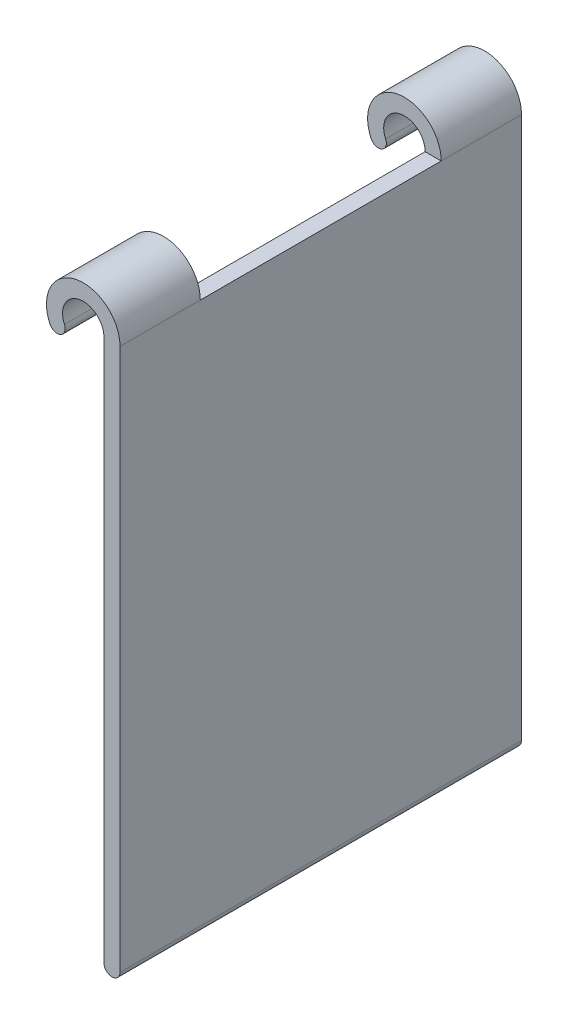
ISO-10303-21;
HEADER;
FILE_DESCRIPTION(('STEP AP214'),'2;1');
FILE_NAME('part.step','',(''),(''),'','','');
FILE_SCHEMA(('AUTOMOTIVE_DESIGN { 1 0 10303 214 1 1 1 1 }'));
ENDSEC;
DATA;
#1=APPLICATION_CONTEXT('core data for automotive mechanical design processes');
#2=APPLICATION_PROTOCOL_DEFINITION('international standard','automotive_design',2000,#1);
#3=PRODUCT_CONTEXT('',#1,'mechanical');
#4=PRODUCT('Part','Part','',(#3));
#5=PRODUCT_RELATED_PRODUCT_CATEGORY('part','',(#4));
#6=PRODUCT_DEFINITION_FORMATION('','',#4);
#7=PRODUCT_DEFINITION_CONTEXT('part definition',#1,'design');
#8=PRODUCT_DEFINITION('design','',#6,#7);
#9=PRODUCT_DEFINITION_SHAPE('','',#8);
#10=(LENGTH_UNIT() NAMED_UNIT(*) SI_UNIT(.MILLI.,.METRE.));
#11=(NAMED_UNIT(*) PLANE_ANGLE_UNIT() SI_UNIT($,.RADIAN.));
#12=(NAMED_UNIT(*) SI_UNIT($,.STERADIAN.) SOLID_ANGLE_UNIT());
#13=UNCERTAINTY_MEASURE_WITH_UNIT(LENGTH_MEASURE(1.E-05),#10,'distance_accuracy_value','');
#14=(GEOMETRIC_REPRESENTATION_CONTEXT(3) GLOBAL_UNCERTAINTY_ASSIGNED_CONTEXT((#13)) GLOBAL_UNIT_ASSIGNED_CONTEXT((#10,
#11,#12)) REPRESENTATION_CONTEXT('',''));
#15=CARTESIAN_POINT('',(0.,0.,0.));
#16=DIRECTION('',(0.,0.,1.));
#17=DIRECTION('',(1.,0.,0.));
#18=AXIS2_PLACEMENT_3D('',#15,#16,#17);
#19=CARTESIAN_POINT('',(3.2766,0.,57.15));
#20=DIRECTION('',(0.,-1.,0.));
#21=DIRECTION('',(0.,0.,-1.));
#22=AXIS2_PLACEMENT_3D('',#19,#20,#21);
#23=PLANE('',#22);
#24=DIRECTION('',(-1.,0.,0.));
#25=VECTOR('',#24,1.);
#26=CARTESIAN_POINT('',(3.2766,0.,44.45));
#27=LINE('',#26,#25);
#28=CARTESIAN_POINT('',(5.81660000000001,0.,44.45));
#29=VERTEX_POINT('',#28);
#30=CARTESIAN_POINT('',(3.27659999999998,0.,44.45));
#31=VERTEX_POINT('',#30);
#32=EDGE_CURVE('E11',#29,#31,#27,.T.);
#33=ORIENTED_EDGE('',*,*,#32,.F.);
#34=DIRECTION('',(0.,0.,-1.));
#35=VECTOR('',#34,1.);
#36=CARTESIAN_POINT('',(5.81660000000001,0.,57.15));
#37=LINE('',#36,#35);
#38=CARTESIAN_POINT('',(5.8166,0.,6.35));
#39=VERTEX_POINT('',#38);
#40=EDGE_CURVE('E199',#29,#39,#37,.T.);
#41=ORIENTED_EDGE('',*,*,#40,.T.);
#42=DIRECTION('',(-1.,0.,0.));
#43=VECTOR('',#42,1.);
#44=CARTESIAN_POINT('',(3.2766,0.,6.35));
#45=LINE('',#44,#43);
#46=CARTESIAN_POINT('',(3.2766,0.,6.35));
#47=VERTEX_POINT('',#46);
#48=EDGE_CURVE('E185',#39,#47,#45,.T.);
#49=ORIENTED_EDGE('',*,*,#48,.T.);
#50=DIRECTION('',(0.,0.,-1.));
#51=VECTOR('',#50,1.);
#52=CARTESIAN_POINT('',(3.2766,0.,57.15));
#53=LINE('',#52,#51);
#54=EDGE_CURVE('E194',#31,#47,#53,.T.);
#55=ORIENTED_EDGE('',*,*,#54,.F.);
#56=EDGE_LOOP('',(#33,#41,#49,#55));
#57=FACE_BOUND('',#56,.T.);
#58=ADVANCED_FACE('F40',(#57),#23,.F.);
#59=CARTESIAN_POINT('',(4.54660000000001,-85.725,6.35));
#60=DIRECTION('',(0.,0.,-1.));
#61=DIRECTION('',(-1.,0.,0.));
#62=AXIS2_PLACEMENT_3D('',#59,#60,#61);
#63=CYLINDRICAL_SURFACE('',#62,1.27);
#64=DIRECTION('',(0.,0.,-1.));
#65=VECTOR('',#64,1.);
#66=CARTESIAN_POINT('',(3.27660000000002,-85.725,6.35));
#67=LINE('',#66,#65);
#68=CARTESIAN_POINT('',(3.2766,-85.725,57.15));
#69=VERTEX_POINT('',#68);
#70=CARTESIAN_POINT('',(3.27660000000002,-85.725,-6.35));
#71=VERTEX_POINT('',#70);
#72=EDGE_CURVE('E212',#69,#71,#67,.T.);
#73=ORIENTED_EDGE('',*,*,#72,.T.);
#74=CARTESIAN_POINT('',(4.54660000000001,-85.725,-6.35));
#75=DIRECTION('',(0.,0.,1.));
#76=DIRECTION('',(1.,0.,0.));
#77=AXIS2_PLACEMENT_3D('',#74,#75,#76);
#78=CIRCLE('',#77,1.27);
#79=CARTESIAN_POINT('',(5.81660000000001,-85.725,-6.35));
#80=VERTEX_POINT('',#79);
#81=EDGE_CURVE('E203',#71,#80,#78,.T.);
#82=ORIENTED_EDGE('',*,*,#81,.T.);
#83=DIRECTION('',(0.,0.,-1.));
#84=VECTOR('',#83,1.);
#85=CARTESIAN_POINT('',(5.81660000000001,-85.725,6.35));
#86=LINE('',#85,#84);
#87=CARTESIAN_POINT('',(5.81660000000001,-85.725,57.15));
#88=VERTEX_POINT('',#87);
#89=EDGE_CURVE('E48',#88,#80,#86,.T.);
#90=ORIENTED_EDGE('',*,*,#89,.F.);
#91=CARTESIAN_POINT('',(4.54660000000001,-85.725,57.15));
#92=DIRECTION('',(0.,0.,1.));
#93=DIRECTION('',(1.,0.,0.));
#94=AXIS2_PLACEMENT_3D('',#91,#92,#93);
#95=CIRCLE('',#94,1.27000000000001);
#96=EDGE_CURVE('E189',#69,#88,#95,.T.);
#97=ORIENTED_EDGE('',*,*,#96,.F.);
#98=EDGE_LOOP('',(#73,#82,#90,#97));
#99=FACE_BOUND('',#98,.T.);
#100=ADVANCED_FACE('F42',(#99),#63,.T.);
#101=CARTESIAN_POINT('',(5.8166,0.,6.35));
#102=DIRECTION('',(-1.,0.,0.));
#103=DIRECTION('',(0.,-1.,0.));
#104=AXIS2_PLACEMENT_3D('',#101,#102,#103);
#105=PLANE('',#104);
#106=ORIENTED_EDGE('',*,*,#89,.T.);
#107=DIRECTION('',(0.,1.,0.));
#108=VECTOR('',#107,1.);
#109=CARTESIAN_POINT('',(5.8166,0.,-6.35));
#110=LINE('',#109,#108);
#111=CARTESIAN_POINT('',(5.8166,0.,-6.35));
#112=VERTEX_POINT('',#111);
#113=EDGE_CURVE('E215',#80,#112,#110,.T.);
#114=ORIENTED_EDGE('',*,*,#113,.T.);
#115=DIRECTION('',(0.,0.,-1.));
#116=VECTOR('',#115,1.);
#117=CARTESIAN_POINT('',(5.8166,0.,6.35));
#118=LINE('',#117,#116);
#119=EDGE_CURVE('E235',#39,#112,#118,.T.);
#120=ORIENTED_EDGE('',*,*,#119,.F.);
#121=ORIENTED_EDGE('',*,*,#40,.F.);
#122=CARTESIAN_POINT('',(5.81660000000001,0.,57.15));
#123=VERTEX_POINT('',#122);
#124=EDGE_CURVE('E200',#123,#29,#37,.T.);
#125=ORIENTED_EDGE('',*,*,#124,.F.);
#126=DIRECTION('',(0.,1.,0.));
#127=VECTOR('',#126,1.);
#128=CARTESIAN_POINT('',(5.81660000000001,0.,57.15));
#129=LINE('',#128,#127);
#130=EDGE_CURVE('E192',#88,#123,#129,.T.);
#131=ORIENTED_EDGE('',*,*,#130,.F.);
#132=EDGE_LOOP('',(#106,#114,#120,#121,#125,#131));
#133=FACE_BOUND('',#132,.T.);
#134=ADVANCED_FACE('F240',(#133),#105,.F.);
#135=CARTESIAN_POINT('',(0.,0.,6.35));
#136=DIRECTION('',(0.,0.,-1.));
#137=DIRECTION('',(-1.,0.,0.));
#138=AXIS2_PLACEMENT_3D('',#135,#136,#137);
#139=CYLINDRICAL_SURFACE('',#138,5.8166);
#140=CARTESIAN_POINT('',(0.,0.,-6.35));
#141=DIRECTION('',(0.,0.,1.));
#142=DIRECTION('',(1.,0.,0.));
#143=AXIS2_PLACEMENT_3D('',#140,#141,#142);
#144=CIRCLE('',#143,5.8166);
#145=CARTESIAN_POINT('',(-5.27162987407737,-2.45820138124096,-6.35));
#146=VERTEX_POINT('',#145);
#147=EDGE_CURVE('E217',#112,#146,#144,.T.);
#148=ORIENTED_EDGE('',*,*,#147,.T.);
#149=DIRECTION('',(0.,0.,-1.));
#150=VECTOR('',#149,1.);
#151=CARTESIAN_POINT('',(-5.27162987407737,-2.45820138124096,6.35));
#152=LINE('',#151,#150);
#153=CARTESIAN_POINT('',(-5.27162987407737,-2.45820138124096,6.35));
#154=VERTEX_POINT('',#153);
#155=EDGE_CURVE('E232',#154,#146,#152,.T.);
#156=ORIENTED_EDGE('',*,*,#155,.F.);
#157=CARTESIAN_POINT('',(0.,0.,6.35));
#158=DIRECTION('',(0.,0.,1.));
#159=DIRECTION('',(1.,0.,0.));
#160=AXIS2_PLACEMENT_3D('',#157,#158,#159);
#161=CIRCLE('',#160,5.8166);
#162=EDGE_CURVE('E204',#39,#154,#161,.T.);
#163=ORIENTED_EDGE('',*,*,#162,.F.);
#164=ORIENTED_EDGE('',*,*,#119,.T.);
#165=EDGE_LOOP('',(#148,#156,#163,#164));
#166=FACE_BOUND('',#165,.T.);
#167=ADVANCED_FACE('F265',(#166),#139,.T.);
#168=CARTESIAN_POINT('',(-4.12061898454083,-1.92147618883027,6.35));
#169=DIRECTION('',(0.,0.,-1.));
#170=DIRECTION('',(-1.,0.,0.));
#171=AXIS2_PLACEMENT_3D('',#168,#169,#170);
#172=CYLINDRICAL_SURFACE('',#171,1.27);
#173=CARTESIAN_POINT('',(-4.12061898454083,-1.92147618883027,-6.35));
#174=DIRECTION('',(0.,0.,1.));
#175=DIRECTION('',(1.,0.,0.));
#176=AXIS2_PLACEMENT_3D('',#173,#174,#175);
#177=CIRCLE('',#176,1.27);
#178=CARTESIAN_POINT('',(-2.96960809500428,-1.38475099641958,-6.35));
#179=VERTEX_POINT('',#178);
#180=EDGE_CURVE('E219',#146,#179,#177,.T.);
#181=ORIENTED_EDGE('',*,*,#180,.T.);
#182=DIRECTION('',(0.,0.,-1.));
#183=VECTOR('',#182,1.);
#184=CARTESIAN_POINT('',(-2.96960809500428,-1.38475099641958,6.35));
#185=LINE('',#184,#183);
#186=CARTESIAN_POINT('',(-2.96960809500428,-1.38475099641958,6.35));
#187=VERTEX_POINT('',#186);
#188=EDGE_CURVE('E229',#187,#179,#185,.T.);
#189=ORIENTED_EDGE('',*,*,#188,.F.);
#190=CARTESIAN_POINT('',(-4.12061898454083,-1.92147618883027,6.35));
#191=DIRECTION('',(0.,0.,1.));
#192=DIRECTION('',(1.,0.,0.));
#193=AXIS2_PLACEMENT_3D('',#190,#191,#192);
#194=CIRCLE('',#193,1.27);
#195=EDGE_CURVE('E206',#154,#187,#194,.T.);
#196=ORIENTED_EDGE('',*,*,#195,.F.);
#197=ORIENTED_EDGE('',*,*,#155,.T.);
#198=EDGE_LOOP('',(#181,#189,#196,#197));
#199=FACE_BOUND('',#198,.T.);
#200=ADVANCED_FACE('F261',(#199),#172,.T.);
#201=CARTESIAN_POINT('',(0.,0.,6.35));
#202=DIRECTION('',(0.,0.,-1.));
#203=DIRECTION('',(-1.,0.,0.));
#204=AXIS2_PLACEMENT_3D('',#201,#202,#203);
#205=CYLINDRICAL_SURFACE('',#204,3.2766);
#206=CARTESIAN_POINT('',(0.,0.,-6.35));
#207=DIRECTION('',(0.,0.,-1.));
#208=DIRECTION('',(1.,0.,0.));
#209=AXIS2_PLACEMENT_3D('',#206,#207,#208);
#210=CIRCLE('',#209,3.2766);
#211=CARTESIAN_POINT('',(3.2766,0.,-6.35));
#212=VERTEX_POINT('',#211);
#213=EDGE_CURVE('E221',#179,#212,#210,.T.);
#214=ORIENTED_EDGE('',*,*,#213,.T.);
#215=DIRECTION('',(0.,0.,-1.));
#216=VECTOR('',#215,1.);
#217=CARTESIAN_POINT('',(3.2766,0.,6.35));
#218=LINE('',#217,#216);
#219=EDGE_CURVE('E226',#47,#212,#218,.T.);
#220=ORIENTED_EDGE('',*,*,#219,.F.);
#221=CARTESIAN_POINT('',(0.,0.,6.35));
#222=DIRECTION('',(0.,0.,-1.));
#223=DIRECTION('',(1.,0.,0.));
#224=AXIS2_PLACEMENT_3D('',#221,#222,#223);
#225=CIRCLE('',#224,3.2766);
#226=EDGE_CURVE('E209',#187,#47,#225,.T.);
#227=ORIENTED_EDGE('',*,*,#226,.F.);
#228=ORIENTED_EDGE('',*,*,#188,.T.);
#229=EDGE_LOOP('',(#214,#220,#227,#228));
#230=FACE_BOUND('',#229,.T.);
#231=ADVANCED_FACE('F256',(#230),#205,.F.);
#232=CARTESIAN_POINT('',(3.2766,0.,6.35));
#233=DIRECTION('',(1.,0.,0.));
#234=DIRECTION('',(0.,1.,0.));
#235=AXIS2_PLACEMENT_3D('',#232,#233,#234);
#236=PLANE('',#235);
#237=DIRECTION('',(0.,0.,-1.));
#238=VECTOR('',#237,1.);
#239=CARTESIAN_POINT('',(3.2766,-66.802,31.75));
#240=LINE('',#239,#238);
#241=CARTESIAN_POINT('',(3.2766,-66.802,31.75));
#242=VERTEX_POINT('',#241);
#243=CARTESIAN_POINT('',(3.27660000000001,-66.802,19.05));
#244=VERTEX_POINT('',#243);
#245=EDGE_CURVE('E55',#242,#244,#240,.T.);
#246=ORIENTED_EDGE('',*,*,#245,.F.);
#247=DIRECTION('',(0.,1.,0.));
#248=VECTOR('',#247,1.);
#249=CARTESIAN_POINT('',(3.2766,-66.802,31.75));
#250=LINE('',#249,#248);
#251=CARTESIAN_POINT('',(3.27660000000002,-71.6079055338198,31.75));
#252=VERTEX_POINT('',#251);
#253=EDGE_CURVE('E59',#252,#242,#250,.T.);
#254=ORIENTED_EDGE('',*,*,#253,.F.);
#255=DIRECTION('',(0.,0.,-1.));
#256=VECTOR('',#255,1.);
#257=CARTESIAN_POINT('',(3.2766,-71.6079055338198,31.75));
#258=LINE('',#257,#256);
#259=CARTESIAN_POINT('',(3.2766,-71.6079055338198,19.05));
#260=VERTEX_POINT('',#259);
#261=EDGE_CURVE('E164',#252,#260,#258,.T.);
#262=ORIENTED_EDGE('',*,*,#261,.T.);
#263=DIRECTION('',(0.,1.,0.));
#264=VECTOR('',#263,1.);
#265=CARTESIAN_POINT('',(3.2766,-66.802,19.05));
#266=LINE('',#265,#264);
#267=EDGE_CURVE('E155',#260,#244,#266,.T.);
#268=ORIENTED_EDGE('',*,*,#267,.T.);
#269=EDGE_LOOP('',(#246,#254,#262,#268));
#270=FACE_BOUND('',#269,.T.);
#271=CARTESIAN_POINT('',(3.2766,0.,57.15));
#272=VERTEX_POINT('',#271);
#273=EDGE_CURVE('E197',#272,#31,#53,.T.);
#274=ORIENTED_EDGE('',*,*,#273,.T.);
#275=ORIENTED_EDGE('',*,*,#54,.T.);
#276=ORIENTED_EDGE('',*,*,#219,.T.);
#277=DIRECTION('',(0.,-1.,0.));
#278=VECTOR('',#277,1.);
#279=CARTESIAN_POINT('',(3.2766,0.,-6.35));
#280=LINE('',#279,#278);
#281=EDGE_CURVE('E207',#212,#71,#280,.T.);
#282=ORIENTED_EDGE('',*,*,#281,.T.);
#283=ORIENTED_EDGE('',*,*,#72,.F.);
#284=DIRECTION('',(0.,-1.,0.));
#285=VECTOR('',#284,1.);
#286=CARTESIAN_POINT('',(3.2766,0.,57.15));
#287=LINE('',#286,#285);
#288=EDGE_CURVE('E186',#272,#69,#287,.T.);
#289=ORIENTED_EDGE('',*,*,#288,.F.);
#290=EDGE_LOOP('',(#274,#275,#276,#282,#283,#289));
#291=FACE_BOUND('',#290,.T.);
#292=ADVANCED_FACE('F252',(#270,#291),#236,.F.);
#293=CARTESIAN_POINT('',(4.54660000000001,-85.725,6.35));
#294=DIRECTION('',(0.,0.,1.));
#295=DIRECTION('',(1.,0.,0.));
#296=AXIS2_PLACEMENT_3D('',#293,#294,#295);
#297=PLANE('',#296);
#298=ORIENTED_EDGE('',*,*,#48,.F.);
#299=ORIENTED_EDGE('',*,*,#162,.T.);
#300=ORIENTED_EDGE('',*,*,#195,.T.);
#301=ORIENTED_EDGE('',*,*,#226,.T.);
#302=EDGE_LOOP('',(#298,#299,#300,#301));
#303=FACE_BOUND('',#302,.T.);
#304=ADVANCED_FACE('F290',(#303),#297,.T.);
#305=CARTESIAN_POINT('',(4.54660000000001,-85.725,-6.35));
#306=DIRECTION('',(0.,0.,1.));
#307=DIRECTION('',(1.,0.,0.));
#308=AXIS2_PLACEMENT_3D('',#305,#306,#307);
#309=PLANE('',#308);
#310=ORIENTED_EDGE('',*,*,#81,.F.);
#311=ORIENTED_EDGE('',*,*,#281,.F.);
#312=ORIENTED_EDGE('',*,*,#213,.F.);
#313=ORIENTED_EDGE('',*,*,#180,.F.);
#314=ORIENTED_EDGE('',*,*,#147,.F.);
#315=ORIENTED_EDGE('',*,*,#113,.F.);
#316=EDGE_LOOP('',(#310,#311,#312,#313,#314,#315));
#317=FACE_BOUND('',#316,.T.);
#318=ADVANCED_FACE('F248',(#317),#309,.F.);
#319=CARTESIAN_POINT('',(4.54660000000001,-85.725,57.15));
#320=DIRECTION('',(0.,0.,1.));
#321=DIRECTION('',(1.,0.,0.));
#322=AXIS2_PLACEMENT_3D('',#319,#320,#321);
#323=PLANE('',#322);
#324=ORIENTED_EDGE('',*,*,#288,.T.);
#325=ORIENTED_EDGE('',*,*,#96,.T.);
#326=ORIENTED_EDGE('',*,*,#130,.T.);
#327=CARTESIAN_POINT('',(0.,0.,57.15));
#328=DIRECTION('',(0.,0.,1.));
#329=DIRECTION('',(1.,0.,0.));
#330=AXIS2_PLACEMENT_3D('',#327,#328,#329);
#331=CIRCLE('',#330,5.8166);
#332=CARTESIAN_POINT('',(-5.27162987407739,-2.45820138124096,57.15));
#333=VERTEX_POINT('',#332);
#334=EDGE_CURVE('E168',#123,#333,#331,.T.);
#335=ORIENTED_EDGE('',*,*,#334,.T.);
#336=CARTESIAN_POINT('',(-4.12061898454084,-1.92147618883027,57.15));
#337=DIRECTION('',(0.,0.,1.));
#338=DIRECTION('',(1.,0.,0.));
#339=AXIS2_PLACEMENT_3D('',#336,#337,#338);
#340=CIRCLE('',#339,1.27);
#341=CARTESIAN_POINT('',(-2.9696080950043,-1.38475099641958,57.15));
#342=VERTEX_POINT('',#341);
#343=EDGE_CURVE('E170',#333,#342,#340,.T.);
#344=ORIENTED_EDGE('',*,*,#343,.T.);
#345=CARTESIAN_POINT('',(0.,0.,57.15));
#346=DIRECTION('',(0.,0.,-1.));
#347=DIRECTION('',(1.,0.,0.));
#348=AXIS2_PLACEMENT_3D('',#345,#346,#347);
#349=CIRCLE('',#348,3.2766);
#350=EDGE_CURVE('E173',#342,#272,#349,.T.);
#351=ORIENTED_EDGE('',*,*,#350,.T.);
#352=EDGE_LOOP('',(#324,#325,#326,#335,#344,#351));
#353=FACE_BOUND('',#352,.T.);
#354=ADVANCED_FACE('F287',(#353),#323,.T.);
#355=CARTESIAN_POINT('',(4.5466,-85.725,44.45));
#356=DIRECTION('',(0.,0.,1.));
#357=DIRECTION('',(1.,0.,0.));
#358=AXIS2_PLACEMENT_3D('',#355,#356,#357);
#359=PLANE('',#358);
#360=CARTESIAN_POINT('',(0.,0.,44.45));
#361=DIRECTION('',(0.,0.,1.));
#362=DIRECTION('',(1.,0.,0.));
#363=AXIS2_PLACEMENT_3D('',#360,#361,#362);
#364=CIRCLE('',#363,5.8166);
#365=CARTESIAN_POINT('',(-5.27162987407739,-2.45820138124096,44.45));
#366=VERTEX_POINT('',#365);
#367=EDGE_CURVE('E160',#29,#366,#364,.T.);
#368=ORIENTED_EDGE('',*,*,#367,.F.);
#369=ORIENTED_EDGE('',*,*,#32,.T.);
#370=CARTESIAN_POINT('',(0.,0.,44.45));
#371=DIRECTION('',(0.,0.,-1.));
#372=DIRECTION('',(1.,0.,0.));
#373=AXIS2_PLACEMENT_3D('',#370,#371,#372);
#374=CIRCLE('',#373,3.2766);
#375=CARTESIAN_POINT('',(-2.9696080950043,-1.38475099641958,44.45));
#376=VERTEX_POINT('',#375);
#377=EDGE_CURVE('E171',#376,#31,#374,.T.);
#378=ORIENTED_EDGE('',*,*,#377,.F.);
#379=CARTESIAN_POINT('',(-4.12061898454084,-1.92147618883027,44.45));
#380=DIRECTION('',(0.,0.,1.));
#381=DIRECTION('',(1.,0.,0.));
#382=AXIS2_PLACEMENT_3D('',#379,#380,#381);
#383=CIRCLE('',#382,1.27);
#384=EDGE_CURVE('E162',#366,#376,#383,.T.);
#385=ORIENTED_EDGE('',*,*,#384,.F.);
#386=EDGE_LOOP('',(#368,#369,#378,#385));
#387=FACE_BOUND('',#386,.T.);
#388=ADVANCED_FACE('F276',(#387),#359,.F.);
#389=CARTESIAN_POINT('',(0.,0.,57.15));
#390=DIRECTION('',(0.,0.,-1.));
#391=DIRECTION('',(-1.,0.,0.));
#392=AXIS2_PLACEMENT_3D('',#389,#390,#391);
#393=CYLINDRICAL_SURFACE('',#392,5.8166);
#394=ORIENTED_EDGE('',*,*,#367,.T.);
#395=DIRECTION('',(0.,0.,-1.));
#396=VECTOR('',#395,1.);
#397=CARTESIAN_POINT('',(-5.27162987407739,-2.45820138124096,57.15));
#398=LINE('',#397,#396);
#399=EDGE_CURVE('E182',#333,#366,#398,.T.);
#400=ORIENTED_EDGE('',*,*,#399,.F.);
#401=ORIENTED_EDGE('',*,*,#334,.F.);
#402=ORIENTED_EDGE('',*,*,#124,.T.);
#403=EDGE_LOOP('',(#394,#400,#401,#402));
#404=FACE_BOUND('',#403,.T.);
#405=ADVANCED_FACE('F272',(#404),#393,.T.);
#406=CARTESIAN_POINT('',(-4.12061898454084,-1.92147618883027,57.15));
#407=DIRECTION('',(0.,0.,-1.));
#408=DIRECTION('',(-1.,0.,0.));
#409=AXIS2_PLACEMENT_3D('',#406,#407,#408);
#410=CYLINDRICAL_SURFACE('',#409,1.27);
#411=ORIENTED_EDGE('',*,*,#384,.T.);
#412=DIRECTION('',(0.,0.,-1.));
#413=VECTOR('',#412,1.);
#414=CARTESIAN_POINT('',(-2.9696080950043,-1.38475099641958,57.15));
#415=LINE('',#414,#413);
#416=EDGE_CURVE('E175',#342,#376,#415,.T.);
#417=ORIENTED_EDGE('',*,*,#416,.F.);
#418=ORIENTED_EDGE('',*,*,#343,.F.);
#419=ORIENTED_EDGE('',*,*,#399,.T.);
#420=EDGE_LOOP('',(#411,#417,#418,#419));
#421=FACE_BOUND('',#420,.T.);
#422=ADVANCED_FACE('F280',(#421),#410,.T.);
#423=CARTESIAN_POINT('',(0.,0.,57.15));
#424=DIRECTION('',(0.,0.,-1.));
#425=DIRECTION('',(-1.,0.,0.));
#426=AXIS2_PLACEMENT_3D('',#423,#424,#425);
#427=CYLINDRICAL_SURFACE('',#426,3.2766);
#428=ORIENTED_EDGE('',*,*,#377,.T.);
#429=ORIENTED_EDGE('',*,*,#273,.F.);
#430=ORIENTED_EDGE('',*,*,#350,.F.);
#431=ORIENTED_EDGE('',*,*,#416,.T.);
#432=EDGE_LOOP('',(#428,#429,#430,#431));
#433=FACE_BOUND('',#432,.T.);
#434=ADVANCED_FACE('F284',(#433),#427,.F.);
#435=CARTESIAN_POINT('',(0.,-66.802,31.75));
#436=DIRECTION('',(0.,0.,-1.));
#437=DIRECTION('',(-1.,0.,0.));
#438=AXIS2_PLACEMENT_3D('',#435,#436,#437);
#439=CYLINDRICAL_SURFACE('',#438,3.27659999999999);
#440=CARTESIAN_POINT('',(0.,-66.802,19.05));
#441=DIRECTION('',(0.,0.,-1.));
#442=DIRECTION('',(1.,0.,0.));
#443=AXIS2_PLACEMENT_3D('',#440,#441,#442);
#444=CIRCLE('',#443,3.27659999999999);
#445=CARTESIAN_POINT('',(-2.83761883804006,-65.1637,19.05));
#446=VERTEX_POINT('',#445);
#447=EDGE_CURVE('E159',#244,#446,#444,.T.);
#448=ORIENTED_EDGE('',*,*,#447,.T.);
#449=DIRECTION('',(0.,0.,-1.));
#450=VECTOR('',#449,1.);
#451=CARTESIAN_POINT('',(-2.83761883804006,-65.1637,31.75));
#452=LINE('',#451,#450);
#453=CARTESIAN_POINT('',(-2.83761883804006,-65.1637,31.75));
#454=VERTEX_POINT('',#453);
#455=EDGE_CURVE('E143',#454,#446,#452,.T.);
#456=ORIENTED_EDGE('',*,*,#455,.F.);
#457=CARTESIAN_POINT('',(0.,-66.802,31.75));
#458=DIRECTION('',(0.,0.,-1.));
#459=DIRECTION('',(1.,0.,0.));
#460=AXIS2_PLACEMENT_3D('',#457,#458,#459);
#461=CIRCLE('',#460,3.27659999999999);
#462=EDGE_CURVE('E150',#242,#454,#461,.T.);
#463=ORIENTED_EDGE('',*,*,#462,.F.);
#464=ORIENTED_EDGE('',*,*,#245,.T.);
#465=EDGE_LOOP('',(#448,#456,#463,#464));
#466=FACE_BOUND('',#465,.T.);
#467=ADVANCED_FACE('F157',(#466),#439,.F.);
#468=CARTESIAN_POINT('',(-5.03732336365255,-63.8937,31.75));
#469=DIRECTION('',(-0.499999999999996,-0.866025403784441,0.));
#470=DIRECTION('',(0.866025403784441,-0.499999999999996,0.));
#471=AXIS2_PLACEMENT_3D('',#468,#469,#470);
#472=PLANE('',#471);
#473=DIRECTION('',(-0.866025403784441,0.499999999999996,0.));
#474=VECTOR('',#473,1.);
#475=CARTESIAN_POINT('',(-5.03732336365255,-63.8937,19.05));
#476=LINE('',#475,#474);
#477=CARTESIAN_POINT('',(-5.03732336365255,-63.8937,19.05));
#478=VERTEX_POINT('',#477);
#479=EDGE_CURVE('E459',#446,#478,#476,.T.);
#480=ORIENTED_EDGE('',*,*,#479,.T.);
#481=DIRECTION('',(0.,0.,-1.));
#482=VECTOR('',#481,1.);
#483=CARTESIAN_POINT('',(-5.03732336365255,-63.8937,31.75));
#484=LINE('',#483,#482);
#485=CARTESIAN_POINT('',(-5.03732336365255,-63.8937,31.75));
#486=VERTEX_POINT('',#485);
#487=EDGE_CURVE('E146',#486,#478,#484,.T.);
#488=ORIENTED_EDGE('',*,*,#487,.F.);
#489=DIRECTION('',(-0.866025403784441,0.499999999999996,0.));
#490=VECTOR('',#489,1.);
#491=CARTESIAN_POINT('',(-5.03732336365255,-63.8937,31.75));
#492=LINE('',#491,#490);
#493=EDGE_CURVE('E139',#454,#486,#492,.T.);
#494=ORIENTED_EDGE('',*,*,#493,.F.);
#495=ORIENTED_EDGE('',*,*,#455,.T.);
#496=EDGE_LOOP('',(#480,#488,#494,#495));
#497=FACE_BOUND('',#496,.T.);
#498=ADVANCED_FACE('F141',(#497),#472,.F.);
#499=CARTESIAN_POINT('',(0.,-66.802,31.75));
#500=DIRECTION('',(0.,0.,-1.));
#501=DIRECTION('',(-1.,0.,0.));
#502=AXIS2_PLACEMENT_3D('',#499,#500,#501);
#503=CYLINDRICAL_SURFACE('',#502,5.8166);
#504=CARTESIAN_POINT('',(0.,-66.802,19.05));
#505=DIRECTION('',(0.,0.,1.));
#506=DIRECTION('',(1.,0.,0.));
#507=AXIS2_PLACEMENT_3D('',#504,#505,#506);
#508=CIRCLE('',#507,5.8166);
#509=EDGE_CURVE('E461',#478,#260,#508,.T.);
#510=ORIENTED_EDGE('',*,*,#509,.T.);
#511=ORIENTED_EDGE('',*,*,#261,.F.);
#512=CARTESIAN_POINT('',(0.,-66.802,31.75));
#513=DIRECTION('',(0.,0.,1.));
#514=DIRECTION('',(1.,0.,0.));
#515=AXIS2_PLACEMENT_3D('',#512,#513,#514);
#516=CIRCLE('',#515,5.8166);
#517=EDGE_CURVE('E149',#486,#252,#516,.T.);
#518=ORIENTED_EDGE('',*,*,#517,.F.);
#519=ORIENTED_EDGE('',*,*,#487,.T.);
#520=EDGE_LOOP('',(#510,#511,#518,#519));
#521=FACE_BOUND('',#520,.T.);
#522=ADVANCED_FACE('F319',(#521),#503,.T.);
#523=CARTESIAN_POINT('',(0.,-66.802,31.75));
#524=DIRECTION('',(0.,0.,1.));
#525=DIRECTION('',(1.,0.,0.));
#526=AXIS2_PLACEMENT_3D('',#523,#524,#525);
#527=PLANE('',#526);
#528=ORIENTED_EDGE('',*,*,#462,.T.);
#529=ORIENTED_EDGE('',*,*,#493,.T.);
#530=ORIENTED_EDGE('',*,*,#517,.T.);
#531=ORIENTED_EDGE('',*,*,#253,.T.);
#532=EDGE_LOOP('',(#528,#529,#530,#531));
#533=FACE_BOUND('',#532,.T.);
#534=ADVANCED_FACE('F153',(#533),#527,.T.);
#535=CARTESIAN_POINT('',(0.,-66.802,19.05));
#536=DIRECTION('',(0.,0.,1.));
#537=DIRECTION('',(1.,0.,0.));
#538=AXIS2_PLACEMENT_3D('',#535,#536,#537);
#539=PLANE('',#538);
#540=ORIENTED_EDGE('',*,*,#447,.F.);
#541=ORIENTED_EDGE('',*,*,#267,.F.);
#542=ORIENTED_EDGE('',*,*,#509,.F.);
#543=ORIENTED_EDGE('',*,*,#479,.F.);
#544=EDGE_LOOP('',(#540,#541,#542,#543));
#545=FACE_BOUND('',#544,.T.);
#546=ADVANCED_FACE('F323',(#545),#539,.F.);
#547=CLOSED_SHELL('',(#58,#100,#134,#167,#200,#231,#292,#304,#318,#354,#388,#405,#422,#434,#467,
#498,#522,#534,#546));
#548=MANIFOLD_SOLID_BREP('B2',#547);
#549=ADVANCED_BREP_SHAPE_REPRESENTATION('',(#18,#548),#14);
#550=SHAPE_DEFINITION_REPRESENTATION(#9,#549);
ENDSEC;
END-ISO-10303-21;
